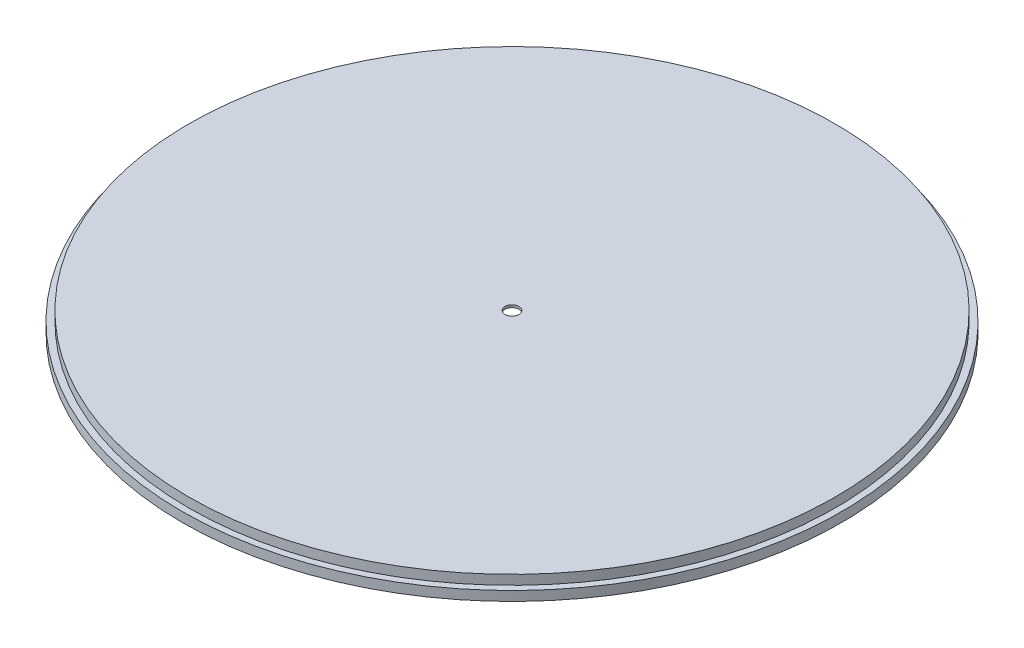
ISO-10303-21;
HEADER;
FILE_DESCRIPTION(('STEP AP214'),'2;1');
FILE_NAME('part.step','',(''),(''),'','','');
FILE_SCHEMA(('AUTOMOTIVE_DESIGN { 1 0 10303 214 1 1 1 1 }'));
ENDSEC;
DATA;
#1=APPLICATION_CONTEXT('core data for automotive mechanical design processes');
#2=APPLICATION_PROTOCOL_DEFINITION('international standard','automotive_design',2000,#1);
#3=PRODUCT_CONTEXT('',#1,'mechanical');
#4=PRODUCT('Part','Part','',(#3));
#5=PRODUCT_RELATED_PRODUCT_CATEGORY('part','',(#4));
#6=PRODUCT_DEFINITION_FORMATION('','',#4);
#7=PRODUCT_DEFINITION_CONTEXT('part definition',#1,'design');
#8=PRODUCT_DEFINITION('design','',#6,#7);
#9=PRODUCT_DEFINITION_SHAPE('','',#8);
#10=(LENGTH_UNIT() NAMED_UNIT(*) SI_UNIT(.MILLI.,.METRE.));
#11=(NAMED_UNIT(*) PLANE_ANGLE_UNIT() SI_UNIT($,.RADIAN.));
#12=(NAMED_UNIT(*) SI_UNIT($,.STERADIAN.) SOLID_ANGLE_UNIT());
#13=UNCERTAINTY_MEASURE_WITH_UNIT(LENGTH_MEASURE(1.E-05),#10,'distance_accuracy_value','');
#14=(GEOMETRIC_REPRESENTATION_CONTEXT(3) GLOBAL_UNCERTAINTY_ASSIGNED_CONTEXT((#13)) GLOBAL_UNIT_ASSIGNED_CONTEXT((#10,
#11,#12)) REPRESENTATION_CONTEXT('',''));
#15=CARTESIAN_POINT('',(0.,0.,0.));
#16=DIRECTION('',(0.,0.,1.));
#17=DIRECTION('',(1.,0.,0.));
#18=AXIS2_PLACEMENT_3D('',#15,#16,#17);
#19=CARTESIAN_POINT('',(0.,-1.5,0.));
#20=DIRECTION('',(0.,1.,0.));
#21=DIRECTION('',(0.,0.,1.));
#22=AXIS2_PLACEMENT_3D('',#19,#20,#21);
#23=CYLINDRICAL_SURFACE('',#22,25.5);
#24=CARTESIAN_POINT('',(0.,0.,0.));
#25=DIRECTION('',(0.,1.,0.));
#26=DIRECTION('',(0.,0.,1.));
#27=AXIS2_PLACEMENT_3D('',#24,#25,#26);
#28=CIRCLE('',#27,25.5);
#29=CARTESIAN_POINT('',(0.,0.,25.5));
#30=VERTEX_POINT('',#29);
#31=EDGE_CURVE('E10',#30,#30,#28,.T.);
#32=ORIENTED_EDGE('',*,*,#31,.F.);
#33=EDGE_LOOP('',(#32));
#34=FACE_BOUND('',#33,.T.);
#35=CARTESIAN_POINT('',(0.,-0.75,0.));
#36=DIRECTION('',(0.,-1.,0.));
#37=DIRECTION('',(0.,0.,-1.));
#38=AXIS2_PLACEMENT_3D('',#35,#36,#37);
#39=CIRCLE('',#38,25.5);
#40=CARTESIAN_POINT('',(0.,-0.75,-25.5));
#41=VERTEX_POINT('',#40);
#42=EDGE_CURVE('E46',#41,#41,#39,.F.);
#43=ORIENTED_EDGE('',*,*,#42,.T.);
#44=EDGE_LOOP('',(#43));
#45=FACE_BOUND('',#44,.T.);
#46=ADVANCED_FACE('F43',(#34,#45),#23,.T.);
#47=CARTESIAN_POINT('',(0.,0.,0.));
#48=DIRECTION('',(0.,1.,0.));
#49=DIRECTION('',(0.,0.,1.));
#50=AXIS2_PLACEMENT_3D('',#47,#48,#49);
#51=PLANE('',#50);
#52=CARTESIAN_POINT('',(0.,0.,0.));
#53=DIRECTION('',(0.,-1.,0.));
#54=DIRECTION('',(0.,0.,-1.));
#55=AXIS2_PLACEMENT_3D('',#52,#53,#54);
#56=CIRCLE('',#55,0.55);
#57=CARTESIAN_POINT('',(0.,0.,-0.55));
#58=VERTEX_POINT('',#57);
#59=EDGE_CURVE('E66',#58,#58,#56,.T.);
#60=ORIENTED_EDGE('',*,*,#59,.T.);
#61=EDGE_LOOP('',(#60));
#62=FACE_BOUND('',#61,.T.);
#63=ORIENTED_EDGE('',*,*,#31,.T.);
#64=EDGE_LOOP('',(#63));
#65=FACE_BOUND('',#64,.T.);
#66=ADVANCED_FACE('F70',(#62,#65),#51,.T.);
#67=CARTESIAN_POINT('',(0.,-0.75,0.));
#68=DIRECTION('',(0.,-1.,0.));
#69=DIRECTION('',(0.,0.,-1.));
#70=AXIS2_PLACEMENT_3D('',#67,#68,#69);
#71=CYLINDRICAL_SURFACE('',#70,26.);
#72=CARTESIAN_POINT('',(0.,-0.75,0.));
#73=DIRECTION('',(0.,-1.,0.));
#74=DIRECTION('',(0.,0.,-1.));
#75=AXIS2_PLACEMENT_3D('',#72,#73,#74);
#76=CIRCLE('',#75,26.);
#77=CARTESIAN_POINT('',(0.,-0.75,-26.));
#78=VERTEX_POINT('',#77);
#79=EDGE_CURVE('E53',#78,#78,#76,.T.);
#80=ORIENTED_EDGE('',*,*,#79,.T.);
#81=EDGE_LOOP('',(#80));
#82=FACE_BOUND('',#81,.T.);
#83=CARTESIAN_POINT('',(0.,-1.5,0.));
#84=DIRECTION('',(0.,-1.,0.));
#85=DIRECTION('',(0.,0.,-1.));
#86=AXIS2_PLACEMENT_3D('',#83,#84,#85);
#87=CIRCLE('',#86,26.);
#88=CARTESIAN_POINT('',(0.,-1.5,-26.));
#89=VERTEX_POINT('',#88);
#90=EDGE_CURVE('E55',#89,#89,#87,.T.);
#91=ORIENTED_EDGE('',*,*,#90,.F.);
#92=EDGE_LOOP('',(#91));
#93=FACE_BOUND('',#92,.T.);
#94=ADVANCED_FACE('F91',(#82,#93),#71,.T.);
#95=CARTESIAN_POINT('',(0.,-0.75,0.));
#96=DIRECTION('',(0.,-1.,0.));
#97=DIRECTION('',(0.,0.,-1.));
#98=AXIS2_PLACEMENT_3D('',#95,#96,#97);
#99=PLANE('',#98);
#100=ORIENTED_EDGE('',*,*,#42,.F.);
#101=EDGE_LOOP('',(#100));
#102=FACE_BOUND('',#101,.T.);
#103=ORIENTED_EDGE('',*,*,#79,.F.);
#104=EDGE_LOOP('',(#103));
#105=FACE_BOUND('',#104,.T.);
#106=ADVANCED_FACE('F87',(#102,#105),#99,.F.);
#107=CARTESIAN_POINT('',(0.,-1.5,0.));
#108=DIRECTION('',(0.,1.,0.));
#109=DIRECTION('',(0.,0.,1.));
#110=AXIS2_PLACEMENT_3D('',#107,#108,#109);
#111=PLANE('',#110);
#112=CARTESIAN_POINT('',(0.,-1.5,0.));
#113=DIRECTION('',(0.,-1.,0.));
#114=DIRECTION('',(0.,0.,-1.));
#115=AXIS2_PLACEMENT_3D('',#112,#113,#114);
#116=CIRCLE('',#115,4.35);
#117=CARTESIAN_POINT('',(0.,-1.5,-4.35));
#118=VERTEX_POINT('',#117);
#119=EDGE_CURVE('E58',#118,#118,#116,.T.);
#120=ORIENTED_EDGE('',*,*,#119,.F.);
#121=EDGE_LOOP('',(#120));
#122=FACE_BOUND('',#121,.T.);
#123=ORIENTED_EDGE('',*,*,#90,.T.);
#124=EDGE_LOOP('',(#123));
#125=FACE_BOUND('',#124,.T.);
#126=ADVANCED_FACE('F81',(#122,#125),#111,.F.);
#127=CARTESIAN_POINT('',(0.,-1.5,0.));
#128=DIRECTION('',(0.,-1.,0.));
#129=DIRECTION('',(0.,0.,-1.));
#130=AXIS2_PLACEMENT_3D('',#127,#128,#129);
#131=CONICAL_SURFACE('',#130,4.35,1.24117191937415);
#132=CARTESIAN_POINT('',(0.,-0.2,0.));
#133=DIRECTION('',(0.,-1.,0.));
#134=DIRECTION('',(0.,0.,-1.));
#135=AXIS2_PLACEMENT_3D('',#132,#133,#134);
#136=CIRCLE('',#135,0.55);
#137=CARTESIAN_POINT('',(0.,-0.2,-0.55));
#138=VERTEX_POINT('',#137);
#139=EDGE_CURVE('E63',#138,#138,#136,.T.);
#140=ORIENTED_EDGE('',*,*,#139,.F.);
#141=EDGE_LOOP('',(#140));
#142=FACE_BOUND('',#141,.T.);
#143=ORIENTED_EDGE('',*,*,#119,.T.);
#144=EDGE_LOOP('',(#143));
#145=FACE_BOUND('',#144,.T.);
#146=ADVANCED_FACE('F75',(#142,#145),#131,.F.);
#147=CARTESIAN_POINT('',(0.,-1.5,0.));
#148=DIRECTION('',(0.,-1.,0.));
#149=DIRECTION('',(0.,0.,-1.));
#150=AXIS2_PLACEMENT_3D('',#147,#148,#149);
#151=CYLINDRICAL_SURFACE('',#150,0.55);
#152=ORIENTED_EDGE('',*,*,#59,.F.);
#153=EDGE_LOOP('',(#152));
#154=FACE_BOUND('',#153,.T.);
#155=ORIENTED_EDGE('',*,*,#139,.T.);
#156=EDGE_LOOP('',(#155));
#157=FACE_BOUND('',#156,.T.);
#158=ADVANCED_FACE('F72',(#154,#157),#151,.F.);
#159=CLOSED_SHELL('',(#46,#66,#94,#106,#126,#146,#158));
#160=MANIFOLD_SOLID_BREP('B2',#159);
#161=ADVANCED_BREP_SHAPE_REPRESENTATION('',(#18,#160),#14);
#162=SHAPE_DEFINITION_REPRESENTATION(#9,#161);
ENDSEC;
END-ISO-10303-21;
